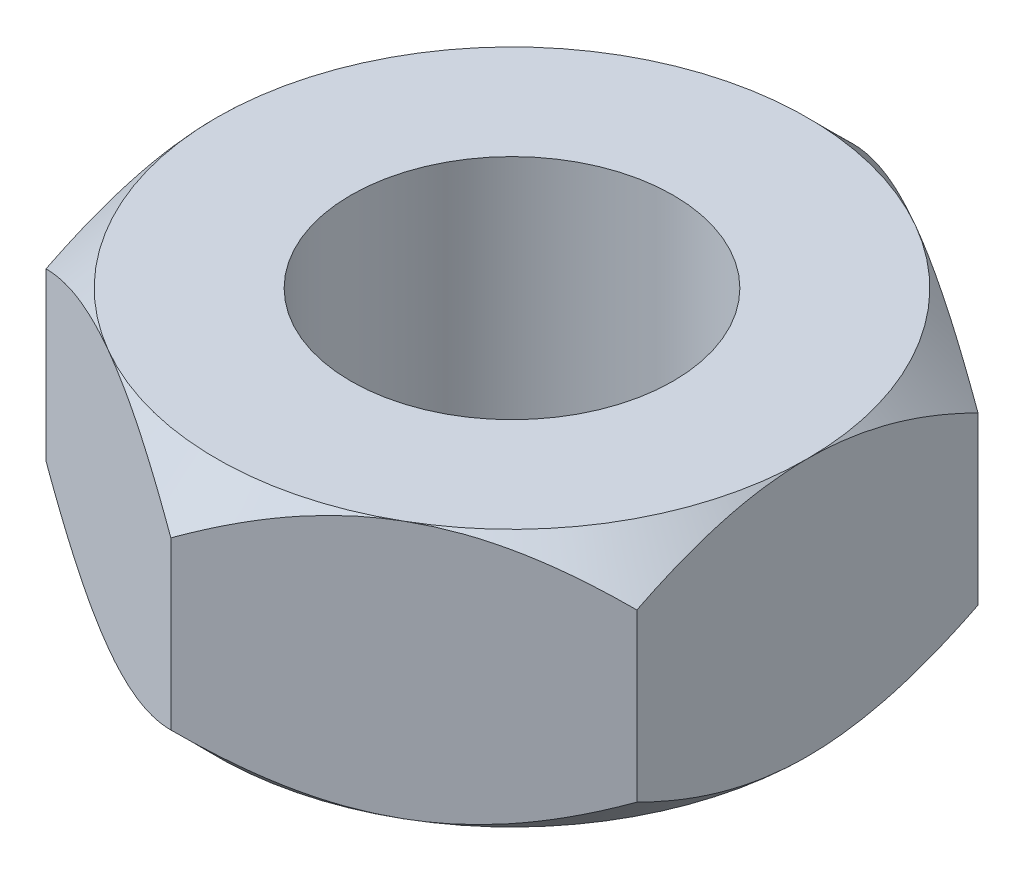
ISO-10303-21;
HEADER;
FILE_DESCRIPTION(('STEP AP214'),'2;1');
FILE_NAME('part.step','',(''),(''),'','','');
FILE_SCHEMA(('AUTOMOTIVE_DESIGN { 1 0 10303 214 1 1 1 1 }'));
ENDSEC;
DATA;
#1=APPLICATION_CONTEXT('core data for automotive mechanical design processes');
#2=APPLICATION_PROTOCOL_DEFINITION('international standard','automotive_design',2000,#1);
#3=PRODUCT_CONTEXT('',#1,'mechanical');
#4=PRODUCT('Part','Part','',(#3));
#5=PRODUCT_RELATED_PRODUCT_CATEGORY('part','',(#4));
#6=PRODUCT_DEFINITION_FORMATION('','',#4);
#7=PRODUCT_DEFINITION_CONTEXT('part definition',#1,'design');
#8=PRODUCT_DEFINITION('design','',#6,#7);
#9=PRODUCT_DEFINITION_SHAPE('','',#8);
#10=(LENGTH_UNIT() NAMED_UNIT(*) SI_UNIT(.MILLI.,.METRE.));
#11=(NAMED_UNIT(*) PLANE_ANGLE_UNIT() SI_UNIT($,.RADIAN.));
#12=(NAMED_UNIT(*) SI_UNIT($,.STERADIAN.) SOLID_ANGLE_UNIT());
#13=UNCERTAINTY_MEASURE_WITH_UNIT(LENGTH_MEASURE(1.E-05),#10,'distance_accuracy_value','');
#14=(GEOMETRIC_REPRESENTATION_CONTEXT(3) GLOBAL_UNCERTAINTY_ASSIGNED_CONTEXT((#13)) GLOBAL_UNIT_ASSIGNED_CONTEXT((#10,
#11,#12)) REPRESENTATION_CONTEXT('',''));
#15=CARTESIAN_POINT('',(0.,0.,0.));
#16=DIRECTION('',(0.,0.,1.));
#17=DIRECTION('',(1.,0.,0.));
#18=AXIS2_PLACEMENT_3D('',#15,#16,#17);
#19=CARTESIAN_POINT('',(2.75,2.4,-1.58771324027147));
#20=DIRECTION('',(-0.5,0.,0.866025403784439));
#21=DIRECTION('',(0.866025403784439,0.,0.5));
#22=AXIS2_PLACEMENT_3D('',#19,#20,#21);
#23=PLANE('',#22);
#24=CARTESIAN_POINT('',(-0.000200000000000099,0.425541956894917,-3.17554195059678));
#25=CARTESIAN_POINT('',(0.0943308997251542,0.371010993648795,-3.12096451019372));
#26=CARTESIAN_POINT('',(0.190442479964884,0.319682711582697,-3.06547446347008));
#27=CARTESIAN_POINT('',(0.386424562220433,0.225701848080582,-2.95232415552349));
#28=CARTESIAN_POINT('',(0.486313702554479,0.183101557290613,-2.89465313346251));
#29=CARTESIAN_POINT('',(0.687735384613651,0.110126428064951,-2.77836227110502));
#30=CARTESIAN_POINT('',(0.789216629687066,0.0795681696782812,-2.71977204694419));
#31=CARTESIAN_POINT('',(0.994413197899185,0.0324868359858975,-2.60130175305013));
#32=CARTESIAN_POINT('',(1.0981222526129,0.0159286158992995,-2.54142530239377));
#33=CARTESIAN_POINT('',(1.27685963791476,0.000988807876371814,-2.43823122487549));
#34=CARTESIAN_POINT('',(1.3516570606668,-0.00122274739977228,-2.39504691271491));
#35=CARTESIAN_POINT('',(1.50112963486142,0.00250321758747816,-2.30874888176718));
#36=CARTESIAN_POINT('',(1.57580473425184,0.00844359470887878,-2.26563519303236));
#37=CARTESIAN_POINT('',(1.72444981947433,0.0281353796034435,-2.17981491306544));
#38=CARTESIAN_POINT('',(1.79841892228176,0.041895524927416,-2.13710883164785));
#39=CARTESIAN_POINT('',(1.94507802102907,0.0764715186152213,-2.05243516150698));
#40=CARTESIAN_POINT('',(2.01776811458046,0.0972868260643694,-2.01046751642767));
#41=CARTESIAN_POINT('',(2.2039546543123,0.159080271248456,-1.90297266759401));
#42=CARTESIAN_POINT('',(2.31629676656898,0.204715808523916,-1.83811191884128));
#43=CARTESIAN_POINT('',(2.48148610419533,0.281754639324321,-1.74273981029545));
#44=CARTESIAN_POINT('',(2.53592338410088,0.308822507519967,-1.71131043208803));
#45=CARTESIAN_POINT('',(2.64378961648056,0.365425651693315,-1.64903383378715));
#46=CARTESIAN_POINT('',(2.69721916353136,0.394959413135863,-1.61818627041469));
#47=CARTESIAN_POINT('',(2.7502,0.425541956894916,-1.58759777021763));
#48=B_SPLINE_CURVE_WITH_KNOTS('',3,(#24,#25,#26,#27,#28,#29,#30,#31,#32,#33,#34,#35,#36,#37,#38,
#39,#40,#41,#42,#43,#44,#45,#46,#47),.UNSPECIFIED.,.F.,.F.,(4,2,2,2,2,2,2,2,2,2,2,4),(0.,
0.366307821078206,0.734749902229767,1.09734036165939,1.45901787214335,1.71784182927395,
1.97675651485027,2.23596107357797,2.49514576375463,2.90682558871158,3.11210731416953,
3.31726387159445),.UNSPECIFIED.);
#49=CARTESIAN_POINT('',(0.,0.425426480542941,-3.17542648054294));
#50=VERTEX_POINT('',#49);
#51=CARTESIAN_POINT('',(1.375,0.,-2.38156986040721));
#52=VERTEX_POINT('',#51);
#53=EDGE_CURVE('E53',#50,#52,#48,.T.);
#54=ORIENTED_EDGE('',*,*,#53,.F.);
#55=DIRECTION('',(0.,-1.,0.));
#56=VECTOR('',#55,1.);
#57=CARTESIAN_POINT('',(0.,2.4,-3.17542648054294));
#58=LINE('',#57,#56);
#59=CARTESIAN_POINT('',(0.,1.97457351945706,-3.17542648054294));
#60=VERTEX_POINT('',#59);
#61=EDGE_CURVE('E279',#60,#50,#58,.T.);
#62=ORIENTED_EDGE('',*,*,#61,.F.);
#63=CARTESIAN_POINT('',(2.7502,1.97445804310508,-1.58759777021763));
#64=CARTESIAN_POINT('',(2.65566910027485,2.02898900635121,-1.64217521062069));
#65=CARTESIAN_POINT('',(2.55955752003512,2.0803172884173,-1.69766525734434));
#66=CARTESIAN_POINT('',(2.36357543777957,2.17429815191942,-1.81081556529092));
#67=CARTESIAN_POINT('',(2.26368629744552,2.21689844270939,-1.8684865873519));
#68=CARTESIAN_POINT('',(2.06226461538635,2.28987357193505,-1.98477744970939));
#69=CARTESIAN_POINT('',(1.96078337031294,2.32043183032172,-2.04336767387023));
#70=CARTESIAN_POINT('',(1.75558680210082,2.3675131640141,-2.16183796776428));
#71=CARTESIAN_POINT('',(1.65187774738711,2.3840713841007,-2.22171441842064));
#72=CARTESIAN_POINT('',(1.47314036208524,2.39901119212363,-2.32490849593893));
#73=CARTESIAN_POINT('',(1.3983429393332,2.40122274739977,-2.3680928080995));
#74=CARTESIAN_POINT('',(1.24887036513858,2.39749678241252,-2.45439083904724));
#75=CARTESIAN_POINT('',(1.17419526574817,2.39155640529112,-2.49750452778206));
#76=CARTESIAN_POINT('',(1.02555018052567,2.37186462039656,-2.58332480774898));
#77=CARTESIAN_POINT('',(0.951581077718242,2.35810447507258,-2.62603088916656));
#78=CARTESIAN_POINT('',(0.804921978970933,2.32352848138478,-2.71070455930743));
#79=CARTESIAN_POINT('',(0.732231885419547,2.30271317393563,-2.75267220438674));
#80=CARTESIAN_POINT('',(0.546045345687704,2.24091972875154,-2.86016705322041));
#81=CARTESIAN_POINT('',(0.43370323343102,2.19528419147608,-2.92502780197313));
#82=CARTESIAN_POINT('',(0.268513895804666,2.11824536067568,-3.02039991051896));
#83=CARTESIAN_POINT('',(0.214076615899116,2.09117749248003,-3.05182928872638));
#84=CARTESIAN_POINT('',(0.106210383519439,2.03457434830668,-3.11410588702726));
#85=CARTESIAN_POINT('',(0.0527808364686395,2.00504058686414,-3.14495345039972));
#86=CARTESIAN_POINT('',(-0.000200000000000289,1.97445804310508,-3.17554195059678));
#87=B_SPLINE_CURVE_WITH_KNOTS('',3,(#63,#64,#65,#66,#67,#68,#69,#70,#71,#72,#73,#74,#75,#76,#77,
#78,#79,#80,#81,#82,#83,#84,#85,#86),.UNSPECIFIED.,.F.,.F.,(4,2,2,2,2,2,2,2,2,2,2,4),(0.,
0.366307821078205,0.734749902229765,1.09734036165939,1.45901787214334,1.71784182927395,
1.97675651485027,2.23596107357797,2.49514576375463,2.90682558871158,3.11210731416953,
3.31726387159445),.UNSPECIFIED.);
#88=CARTESIAN_POINT('',(1.375,2.4,-2.38156986040721));
#89=VERTEX_POINT('',#88);
#90=EDGE_CURVE('E251',#89,#60,#87,.T.);
#91=ORIENTED_EDGE('',*,*,#90,.F.);
#92=CARTESIAN_POINT('',(2.75,1.97457351945706,-1.58771324027147));
#93=VERTEX_POINT('',#92);
#94=EDGE_CURVE('E319',#93,#89,#87,.T.);
#95=ORIENTED_EDGE('',*,*,#94,.F.);
#96=DIRECTION('',(0.,-1.,0.));
#97=VECTOR('',#96,1.);
#98=CARTESIAN_POINT('',(2.75,2.4,-1.58771324027147));
#99=LINE('',#98,#97);
#100=CARTESIAN_POINT('',(2.75,0.42542648054294,-1.58771324027147));
#101=VERTEX_POINT('',#100);
#102=EDGE_CURVE('E321',#93,#101,#99,.T.);
#103=ORIENTED_EDGE('',*,*,#102,.T.);
#104=EDGE_CURVE('E138',#52,#101,#48,.T.);
#105=ORIENTED_EDGE('',*,*,#104,.F.);
#106=EDGE_LOOP('',(#54,#62,#91,#95,#103,#105));
#107=FACE_BOUND('',#106,.T.);
#108=ADVANCED_FACE('F37',(#107),#23,.F.);
#109=CARTESIAN_POINT('',(0.,2.4,-3.17542648054294));
#110=DIRECTION('',(0.5,0.,0.866025403784439));
#111=DIRECTION('',(0.866025403784439,0.,-0.5));
#112=AXIS2_PLACEMENT_3D('',#109,#110,#111);
#113=PLANE('',#112);
#114=CARTESIAN_POINT('',(-2.7502,0.425541956894916,-1.58759777021763));
#115=CARTESIAN_POINT('',(-2.65566910027485,0.371010993648794,-1.64217521062069));
#116=CARTESIAN_POINT('',(-2.55955752003512,0.319682711582697,-1.69766525734434));
#117=CARTESIAN_POINT('',(-2.36357543777957,0.225701848080582,-1.81081556529092));
#118=CARTESIAN_POINT('',(-2.26368629744552,0.183101557290614,-1.8684865873519));
#119=CARTESIAN_POINT('',(-2.06226461538635,0.110126428064951,-1.98477744970939));
#120=CARTESIAN_POINT('',(-1.96078337031294,0.0795681696782818,-2.04336767387023));
#121=CARTESIAN_POINT('',(-1.75558680210082,0.0324868359858976,-2.16183796776428));
#122=CARTESIAN_POINT('',(-1.65187774738711,0.0159286158992991,-2.22171441842064));
#123=CARTESIAN_POINT('',(-1.47314036208524,0.000988807876371699,-2.32490849593893));
#124=CARTESIAN_POINT('',(-1.3983429393332,-0.00122274739977196,-2.36809280809951));
#125=CARTESIAN_POINT('',(-1.24887036513858,0.00250321758747849,-2.45439083904724));
#126=CARTESIAN_POINT('',(-1.17419526574816,0.00844359470887866,-2.49750452778206));
#127=CARTESIAN_POINT('',(-1.02555018052567,0.0281353796034432,-2.58332480774898));
#128=CARTESIAN_POINT('',(-0.951581077718242,0.0418955249274158,-2.62603088916656));
#129=CARTESIAN_POINT('',(-0.804921978970932,0.076471518615221,-2.71070455930743));
#130=CARTESIAN_POINT('',(-0.732231885419546,0.0972868260643687,-2.75267220438674));
#131=CARTESIAN_POINT('',(-0.546045345687703,0.159080271248456,-2.86016705322041));
#132=CARTESIAN_POINT('',(-0.43370323343102,0.204715808523916,-2.92502780197313));
#133=CARTESIAN_POINT('',(-0.268513895804666,0.281754639324322,-3.02039991051896));
#134=CARTESIAN_POINT('',(-0.214076615899116,0.308822507519967,-3.05182928872638));
#135=CARTESIAN_POINT('',(-0.106210383519439,0.365425651693316,-3.11410588702726));
#136=CARTESIAN_POINT('',(-0.0527808364686401,0.394959413135863,-3.14495345039972));
#137=CARTESIAN_POINT('',(0.000199999999999838,0.425541956894917,-3.17554195059678));
#138=B_SPLINE_CURVE_WITH_KNOTS('',3,(#114,#115,#116,#117,#118,#119,#120,#121,#122,#123,#124,
#125,#126,#127,#128,#129,#130,#131,#132,#133,#134,#135,#136,#137),.UNSPECIFIED.,.F.,.F.,(4,2,2,
2,2,2,2,2,2,2,2,4),(0.,0.366307821078205,0.734749902229765,1.09734036165939,1.45901787214334,
1.71784182927395,1.97675651485027,2.23596107357797,2.49514576375463,2.90682558871158,
3.11210731416953,3.31726387159445),.UNSPECIFIED.);
#139=CARTESIAN_POINT('',(-2.75,0.425426480542941,-1.58771324027147));
#140=VERTEX_POINT('',#139);
#141=CARTESIAN_POINT('',(-1.375,0.,-2.38156986040721));
#142=VERTEX_POINT('',#141);
#143=EDGE_CURVE('E61',#140,#142,#138,.T.);
#144=ORIENTED_EDGE('',*,*,#143,.F.);
#145=DIRECTION('',(0.,-1.,0.));
#146=VECTOR('',#145,1.);
#147=CARTESIAN_POINT('',(-2.75,2.4,-1.58771324027147));
#148=LINE('',#147,#146);
#149=CARTESIAN_POINT('',(-2.75,1.97457351945706,-1.58771324027147));
#150=VERTEX_POINT('',#149);
#151=EDGE_CURVE('E272',#150,#140,#148,.T.);
#152=ORIENTED_EDGE('',*,*,#151,.F.);
#153=CARTESIAN_POINT('',(0.000200000000000003,1.97445804310508,-3.17554195059678));
#154=CARTESIAN_POINT('',(-0.0943308997251543,2.02898900635121,-3.12096451019372));
#155=CARTESIAN_POINT('',(-0.190442479964884,2.0803172884173,-3.06547446347008));
#156=CARTESIAN_POINT('',(-0.386424562220432,2.17429815191942,-2.95232415552349));
#157=CARTESIAN_POINT('',(-0.486313702554478,2.21689844270939,-2.89465313346251));
#158=CARTESIAN_POINT('',(-0.68773538461365,2.28987357193505,-2.77836227110502));
#159=CARTESIAN_POINT('',(-0.789216629687065,2.32043183032172,-2.71977204694419));
#160=CARTESIAN_POINT('',(-0.994413197899184,2.3675131640141,-2.60130175305013));
#161=CARTESIAN_POINT('',(-1.09812225261289,2.3840713841007,-2.54142530239377));
#162=CARTESIAN_POINT('',(-1.27685963791476,2.39901119212363,-2.43823122487549));
#163=CARTESIAN_POINT('',(-1.3516570606668,2.40122274739977,-2.39504691271491));
#164=CARTESIAN_POINT('',(-1.50112963486142,2.39749678241252,-2.30874888176718));
#165=CARTESIAN_POINT('',(-1.57580473425184,2.39155640529112,-2.26563519303236));
#166=CARTESIAN_POINT('',(-1.72444981947433,2.37186462039656,-2.17981491306544));
#167=CARTESIAN_POINT('',(-1.79841892228176,2.35810447507258,-2.13710883164785));
#168=CARTESIAN_POINT('',(-1.94507802102907,2.32352848138478,-2.05243516150699));
#169=CARTESIAN_POINT('',(-2.01776811458045,2.30271317393563,-2.01046751642767));
#170=CARTESIAN_POINT('',(-2.2039546543123,2.24091972875154,-1.90297266759401));
#171=CARTESIAN_POINT('',(-2.31629676656898,2.19528419147609,-1.83811191884128));
#172=CARTESIAN_POINT('',(-2.48148610419533,2.11824536067568,-1.74273981029545));
#173=CARTESIAN_POINT('',(-2.53592338410088,2.09117749248003,-1.71131043208803));
#174=CARTESIAN_POINT('',(-2.64378961648056,2.03457434830668,-1.64903383378715));
#175=CARTESIAN_POINT('',(-2.69721916353136,2.00504058686414,-1.61818627041469));
#176=CARTESIAN_POINT('',(-2.7502,1.97445804310508,-1.58759777021763));
#177=B_SPLINE_CURVE_WITH_KNOTS('',3,(#153,#154,#155,#156,#157,#158,#159,#160,#161,#162,#163,
#164,#165,#166,#167,#168,#169,#170,#171,#172,#173,#174,#175,#176),.UNSPECIFIED.,.F.,.F.,(4,2,2,
2,2,2,2,2,2,2,2,4),(0.,0.366307821078205,0.734749902229766,1.09734036165939,1.45901787214334,
1.71784182927395,1.97675651485027,2.23596107357797,2.49514576375463,2.90682558871158,
3.11210731416953,3.31726387159445),.UNSPECIFIED.);
#178=CARTESIAN_POINT('',(-1.375,2.4,-2.38156986040721));
#179=VERTEX_POINT('',#178);
#180=EDGE_CURVE('E244',#179,#150,#177,.T.);
#181=ORIENTED_EDGE('',*,*,#180,.F.);
#182=EDGE_CURVE('E250',#60,#179,#177,.T.);
#183=ORIENTED_EDGE('',*,*,#182,.F.);
#184=ORIENTED_EDGE('',*,*,#61,.T.);
#185=EDGE_CURVE('E161',#142,#50,#138,.T.);
#186=ORIENTED_EDGE('',*,*,#185,.F.);
#187=EDGE_LOOP('',(#144,#152,#181,#183,#184,#186));
#188=FACE_BOUND('',#187,.T.);
#189=ADVANCED_FACE('F257',(#188),#113,.F.);
#190=CARTESIAN_POINT('',(-2.75,2.4,-1.58771324027147));
#191=DIRECTION('',(1.,0.,0.));
#192=DIRECTION('',(0.,0.,-1.));
#193=AXIS2_PLACEMENT_3D('',#190,#191,#192);
#194=PLANE('',#193);
#195=CARTESIAN_POINT('',(-2.75,1.80782169527457,-3.63472675808177));
#196=CARTESIAN_POINT('',(-2.75,1.73868159551658,-3.54800867067655));
#197=CARTESIAN_POINT('',(-2.75,1.67007152903523,-3.46086174429199));
#198=CARTESIAN_POINT('',(-2.75,1.53416325044959,-3.28552270357419));
#199=CARTESIAN_POINT('',(-2.75,1.46686531570245,-3.1973303744659));
#200=CARTESIAN_POINT('',(-2.75,1.33335903557361,-3.01907729974752));
#201=CARTESIAN_POINT('',(-2.75,1.2671627878523,-2.92900746585664));
#202=CARTESIAN_POINT('',(-2.75,1.13676455184732,-2.74744101818951));
#203=CARTESIAN_POINT('',(-2.75,1.07256243131223,-2.65594449963875));
#204=CARTESIAN_POINT('',(-2.75,0.941745248508466,-2.46409925523252));
#205=CARTESIAN_POINT('',(-2.75,0.875329084918676,-2.3636142377344));
#206=CARTESIAN_POINT('',(-2.75,0.746158624444778,-2.16027647672889));
#207=CARTESIAN_POINT('',(-2.75,0.68340501793316,-2.05742329189705));
#208=CARTESIAN_POINT('',(-2.75,0.562856570845539,-1.8492435063339));
#209=CARTESIAN_POINT('',(-2.75,0.50504735060869,-1.74392529752241));
#210=CARTESIAN_POINT('',(-2.75,0.395682588757715,-1.5301155942557));
#211=CARTESIAN_POINT('',(-2.75,0.344123869356362,-1.42162574739516));
#212=CARTESIAN_POINT('',(-2.75,0.255439473232211,-1.21557860926834));
#213=CARTESIAN_POINT('',(-2.75,0.217307461761922,-1.11845883443871));
#214=CARTESIAN_POINT('',(-2.75,0.148806889645974,-0.92146704516136));
#215=CARTESIAN_POINT('',(-2.75,0.118438769533651,-0.821594874895153));
#216=CARTESIAN_POINT('',(-2.75,0.0677604472481918,-0.62161914474097));
#217=CARTESIAN_POINT('',(-2.75,0.0472440969261089,-0.521568786900464));
#218=CARTESIAN_POINT('',(-2.75,0.0167483594558441,-0.319865742327765));
#219=CARTESIAN_POINT('',(-2.75,0.00676577598925033,-0.218213551156163));
#220=CARTESIAN_POINT('',(-2.75,-0.00157687572346488,-0.0208373501382752));
#221=CARTESIAN_POINT('',(-2.75,-0.000628511059595918,0.0748573605473662));
#222=CARTESIAN_POINT('',(-2.75,0.0111576990061719,0.265630424655448));
#223=CARTESIAN_POINT('',(-2.75,0.02199628258147,0.360708731538079));
#224=CARTESIAN_POINT('',(-2.75,0.0530880564530927,0.551195413679047));
#225=CARTESIAN_POINT('',(-2.75,0.0735211251617086,0.646573915648193));
#226=CARTESIAN_POINT('',(-2.75,0.122575452767828,0.835153532568136));
#227=CARTESIAN_POINT('',(-2.75,0.151196768347713,0.928354632441237));
#228=CARTESIAN_POINT('',(-2.75,0.247149315140357,1.20424714804417));
#229=CARTESIAN_POINT('',(-2.75,0.324606232348532,1.38342193830838));
#230=CARTESIAN_POINT('',(-2.75,0.453905269945921,1.64568755109808));
#231=CARTESIAN_POINT('',(-2.75,0.499287963555073,1.73218258063299));
#232=CARTESIAN_POINT('',(-2.75,0.593599497618929,1.90322180873612));
#233=CARTESIAN_POINT('',(-2.75,0.642527734399097,1.98776633618587));
#234=CARTESIAN_POINT('',(-2.75,0.740735245182958,2.15099198708662));
#235=CARTESIAN_POINT('',(-2.75,0.789877652953672,2.22975638476951));
#236=CARTESIAN_POINT('',(-2.75,0.890275075791379,2.38593351043466));
#237=CARTESIAN_POINT('',(-2.75,0.941530246026375,2.46334613854213));
#238=CARTESIAN_POINT('',(-2.75,1.04536650287476,2.61638053077002));
#239=CARTESIAN_POINT('',(-2.75,1.09793391540512,2.69201161152898));
#240=CARTESIAN_POINT('',(-2.75,1.20449319001727,2.84223348207388));
#241=CARTESIAN_POINT('',(-2.75,1.25848465634406,2.9168245522587));
#242=CARTESIAN_POINT('',(-2.75,1.31305976410436,2.99097887767262));
#243=B_SPLINE_CURVE_WITH_KNOTS('',3,(#195,#196,#197,#198,#199,#200,#201,#202,#203,#204,#205,
#206,#207,#208,#209,#210,#211,#212,#213,#214,#215,#216,#217,#218,#219,#220,#221,#222,#223,#224,
#225,#226,#227,#228,#229,#230,#231,#232,#233,#234,#235,#236,#237,#238,#239,#240,#241,#242),
.UNSPECIFIED.,.F.,.F.,(4,2,2,2,2,2,2,2,2,2,2,2,2,2,2,2,2,2,2,2,2,2,2,4),(0.,0.332726398416979,
0.665522381979931,1.00083652102681,1.33612837419665,1.69741813709914,2.05877578270462,
2.41904398029681,2.77912824062089,3.09187955419582,3.4046486097522,3.71055208748452,
4.01636271653859,4.30293767779627,4.58953402981583,4.88173223710371,5.17393246715563,
5.7577463850899,6.05075334560179,6.34371053458314,6.62218871981018,6.90068739392989,
7.17698586222037,7.45320833779313),.UNSPECIFIED.);
#244=CARTESIAN_POINT('',(-2.75,0.42542648054294,1.58771324027147));
#245=VERTEX_POINT('',#244);
#246=CARTESIAN_POINT('',(-2.75,0.,0.));
#247=VERTEX_POINT('',#246);
#248=EDGE_CURVE('E348',#245,#247,#243,.F.);
#249=ORIENTED_EDGE('',*,*,#248,.F.);
#250=DIRECTION('',(0.,-1.,0.));
#251=VECTOR('',#250,1.);
#252=CARTESIAN_POINT('',(-2.75,2.4,1.58771324027147));
#253=LINE('',#252,#251);
#254=CARTESIAN_POINT('',(-2.75,1.97457351945706,1.58771324027147));
#255=VERTEX_POINT('',#254);
#256=EDGE_CURVE('E280',#255,#245,#253,.T.);
#257=ORIENTED_EDGE('',*,*,#256,.F.);
#258=CARTESIAN_POINT('',(-2.75,0.594673478463379,-3.63159740580023));
#259=CARTESIAN_POINT('',(-2.75,0.663739111924605,-3.54494552829104));
#260=CARTESIAN_POINT('',(-2.75,0.732274508966954,-3.45786477734647));
#261=CARTESIAN_POINT('',(-2.75,0.868033033811392,-3.28265811574197));
#262=CARTESIAN_POINT('',(-2.75,0.93525588384878,-3.19453199006624));
#263=CARTESIAN_POINT('',(-2.75,1.06861112137974,-3.01641179952862));
#264=CARTESIAN_POINT('',(-2.75,1.13473140501707,-2.92640864522205));
#265=CARTESIAN_POINT('',(-2.75,1.26497730946444,-2.74497587681638));
#266=CARTESIAN_POINT('',(-2.75,1.32910306258631,-2.65354635794529));
#267=CARTESIAN_POINT('',(-2.75,1.45975239387915,-2.46185395660671));
#268=CARTESIAN_POINT('',(-2.75,1.52607742368194,-2.36145508857773));
#269=CARTESIAN_POINT('',(-2.75,1.65506661758575,-2.15829160376715));
#270=CARTESIAN_POINT('',(-2.75,1.71773009219196,-2.05552654646311));
#271=CARTESIAN_POINT('',(-2.75,1.83810075222815,-1.84752580359659));
#272=CARTESIAN_POINT('',(-2.75,1.8958223125185,-1.74229850199546));
#273=CARTESIAN_POINT('',(-2.75,2.00501617859217,-1.52867505662383));
#274=CARTESIAN_POINT('',(-2.75,2.05649165788959,-1.42028055707746));
#275=CARTESIAN_POINT('',(-2.75,2.145041442528,-1.2143866677897));
#276=CARTESIAN_POINT('',(-2.75,2.18311908483294,-1.11732315321433));
#277=CARTESIAN_POINT('',(-2.75,2.25151549029559,-0.920448074795203));
#278=CARTESIAN_POINT('',(-2.75,2.28183381291981,-0.820636355278947));
#279=CARTESIAN_POINT('',(-2.75,2.33242238922476,-0.620782282547017));
#280=CARTESIAN_POINT('',(-2.75,2.35289835380935,-0.520792956085535));
#281=CARTESIAN_POINT('',(-2.75,2.38332454904157,-0.319216328962869));
#282=CARTESIAN_POINT('',(-2.75,2.39327796131864,-0.217629520754702));
#283=CARTESIAN_POINT('',(-2.75,2.40157901754498,-0.0203618089324159));
#284=CARTESIAN_POINT('',(-2.75,2.40061517105113,0.0752900556449629));
#285=CARTESIAN_POINT('',(-2.75,2.38880745953746,0.265976621504535));
#286=CARTESIAN_POINT('',(-2.75,2.37796285544783,0.361011276084556));
#287=CARTESIAN_POINT('',(-2.75,2.34686833752141,0.551409131527276));
#288=CARTESIAN_POINT('',(-2.75,2.32643886053925,0.646742495494801));
#289=CARTESIAN_POINT('',(-2.75,2.27739986684718,0.835233634308708));
#290=CARTESIAN_POINT('',(-2.75,2.2487902988343,0.928391395506425));
#291=CARTESIAN_POINT('',(-2.75,2.15285297108737,1.20424142323776));
#292=CARTESIAN_POINT('',(-2.75,2.07539640825469,1.38341606255962));
#293=CARTESIAN_POINT('',(-2.75,1.94609784707569,1.64568148824613));
#294=CARTESIAN_POINT('',(-2.75,1.90071528084546,1.73217649781341));
#295=CARTESIAN_POINT('',(-2.75,1.80640398919626,1.90321568433073));
#296=CARTESIAN_POINT('',(-2.75,1.75747586756832,1.98776019022428));
#297=CARTESIAN_POINT('',(-2.75,1.65926825305651,2.15098632417002));
#298=CARTESIAN_POINT('',(-2.75,1.61012560983678,2.22975121626724));
#299=CARTESIAN_POINT('',(-2.75,1.50972768251469,2.38592931253249));
#300=CARTESIAN_POINT('',(-2.75,1.45847224321192,2.463342416805));
#301=CARTESIAN_POINT('',(-2.75,1.35463546676218,2.61637768067024));
#302=CARTESIAN_POINT('',(-2.75,1.30206780525705,2.69200915795809));
#303=CARTESIAN_POINT('',(-2.75,1.19550801676403,2.84223180840298));
#304=CARTESIAN_POINT('',(-2.75,1.14151628556263,2.91682326198111));
#305=CARTESIAN_POINT('',(-2.75,1.0869409068436,2.99097796623128));
#306=B_SPLINE_CURVE_WITH_KNOTS('',3,(#258,#259,#260,#261,#262,#263,#264,#265,#266,#267,#268,
#269,#270,#271,#272,#273,#274,#275,#276,#277,#278,#279,#280,#281,#282,#283,#284,#285,#286,#287,
#288,#289,#290,#291,#292,#293,#294,#295,#296,#297,#298,#299,#300,#301,#302,#303,#304,#305),
.UNSPECIFIED.,.F.,.F.,(4,2,2,2,2,2,2,2,2,2,2,2,2,2,2,2,2,2,2,2,2,2,2,4),(0.,0.33243182981604,
0.664933263509031,0.999951237182682,1.33494693905071,1.69587033067351,2.05686146894863,
2.41676411852393,2.77648313590662,3.0890178571753,3.4015703185919,3.70727074194454,
4.01287870637057,4.29932630149118,4.58579532433567,4.87785952749248,5.16992556242528,
5.753738530255,6.04674526834512,6.33970222553057,6.61818204257394,6.89668235258914,
7.172982223686,7.44920609652945),.UNSPECIFIED.);
#307=CARTESIAN_POINT('',(-2.75,2.4,0.));
#308=VERTEX_POINT('',#307);
#309=EDGE_CURVE('E237',#308,#255,#306,.T.);
#310=ORIENTED_EDGE('',*,*,#309,.F.);
#311=EDGE_CURVE('E243',#150,#308,#306,.T.);
#312=ORIENTED_EDGE('',*,*,#311,.F.);
#313=ORIENTED_EDGE('',*,*,#151,.T.);
#314=EDGE_CURVE('E196',#247,#140,#243,.F.);
#315=ORIENTED_EDGE('',*,*,#314,.F.);
#316=EDGE_LOOP('',(#249,#257,#310,#312,#313,#315));
#317=FACE_BOUND('',#316,.T.);
#318=ADVANCED_FACE('F218',(#317),#194,.F.);
#319=CARTESIAN_POINT('',(-2.75,2.4,1.58771324027147));
#320=DIRECTION('',(0.5,0.,-0.866025403784439));
#321=DIRECTION('',(-0.866025403784439,0.,-0.5));
#322=AXIS2_PLACEMENT_3D('',#319,#320,#321);
#323=PLANE('',#322);
#324=CARTESIAN_POINT('',(0.000199999999999823,0.425541956894916,3.17554195059678));
#325=CARTESIAN_POINT('',(-0.0943308997251543,0.371010993648794,3.12096451019372));
#326=CARTESIAN_POINT('',(-0.190442479964884,0.319682711582696,3.06547446347008));
#327=CARTESIAN_POINT('',(-0.386424562220432,0.225701848080581,2.95232415552349));
#328=CARTESIAN_POINT('',(-0.486313702554479,0.183101557290613,2.89465313346251));
#329=CARTESIAN_POINT('',(-0.68773538461365,0.11012642806495,2.77836227110502));
#330=CARTESIAN_POINT('',(-0.789216629687065,0.079568169678281,2.71977204694419));
#331=CARTESIAN_POINT('',(-0.994413197899184,0.0324868359858968,2.60130175305013));
#332=CARTESIAN_POINT('',(-1.09812225261289,0.0159286158992984,2.54142530239377));
#333=CARTESIAN_POINT('',(-1.27685963791476,0.000988807876370727,2.43823122487549));
#334=CARTESIAN_POINT('',(-1.3516570606668,-0.00122274739977312,2.39504691271491));
#335=CARTESIAN_POINT('',(-1.50112963486142,0.00250321758747727,2.30874888176718));
#336=CARTESIAN_POINT('',(-1.57580473425184,0.0084435947088776,2.26563519303236));
#337=CARTESIAN_POINT('',(-1.72444981947433,0.0281353796034423,2.17981491306544));
#338=CARTESIAN_POINT('',(-1.79841892228176,0.041895524927415,2.13710883164785));
#339=CARTESIAN_POINT('',(-1.94507802102907,0.0764715186152203,2.05243516150698));
#340=CARTESIAN_POINT('',(-2.01776811458045,0.097286826064368,2.01046751642767));
#341=CARTESIAN_POINT('',(-2.2039546543123,0.159080271248455,1.90297266759401));
#342=CARTESIAN_POINT('',(-2.31629676656898,0.204715808523915,1.83811191884128));
#343=CARTESIAN_POINT('',(-2.48148610419533,0.281754639324321,1.74273981029545));
#344=CARTESIAN_POINT('',(-2.53592338410088,0.308822507519967,1.71131043208803));
#345=CARTESIAN_POINT('',(-2.64378961648056,0.365425651693315,1.64903383378715));
#346=CARTESIAN_POINT('',(-2.69721916353136,0.394959413135863,1.61818627041469));
#347=CARTESIAN_POINT('',(-2.7502,0.425541956894915,1.58759777021763));
#348=B_SPLINE_CURVE_WITH_KNOTS('',3,(#324,#325,#326,#327,#328,#329,#330,#331,#332,#333,#334,
#335,#336,#337,#338,#339,#340,#341,#342,#343,#344,#345,#346,#347),.UNSPECIFIED.,.F.,.F.,(4,2,2,
2,2,2,2,2,2,2,2,4),(0.,0.366307821078205,0.734749902229766,1.09734036165939,1.45901787214334,
1.71784182927395,1.97675651485027,2.23596107357797,2.49514576375463,2.90682558871158,
3.11210731416953,3.31726387159445),.UNSPECIFIED.);
#349=CARTESIAN_POINT('',(0.,0.42542648054294,3.17542648054294));
#350=VERTEX_POINT('',#349);
#351=CARTESIAN_POINT('',(-1.375,0.,2.38156986040721));
#352=VERTEX_POINT('',#351);
#353=EDGE_CURVE('E147',#350,#352,#348,.T.);
#354=ORIENTED_EDGE('',*,*,#353,.F.);
#355=DIRECTION('',(0.,-1.,0.));
#356=VECTOR('',#355,1.);
#357=CARTESIAN_POINT('',(0.,2.4,3.17542648054294));
#358=LINE('',#357,#356);
#359=CARTESIAN_POINT('',(0.,1.97457351945706,3.17542648054294));
#360=VERTEX_POINT('',#359);
#361=EDGE_CURVE('E160',#360,#350,#358,.T.);
#362=ORIENTED_EDGE('',*,*,#361,.F.);
#363=CARTESIAN_POINT('',(-2.7502,1.97445804310508,1.58759777021763));
#364=CARTESIAN_POINT('',(-2.65566910027485,2.02898900635121,1.64217521062069));
#365=CARTESIAN_POINT('',(-2.55955752003512,2.0803172884173,1.69766525734434));
#366=CARTESIAN_POINT('',(-2.36357543777957,2.17429815191942,1.81081556529092));
#367=CARTESIAN_POINT('',(-2.26368629744552,2.21689844270939,1.8684865873519));
#368=CARTESIAN_POINT('',(-2.06226461538635,2.28987357193505,1.98477744970939));
#369=CARTESIAN_POINT('',(-1.96078337031294,2.32043183032172,2.04336767387023));
#370=CARTESIAN_POINT('',(-1.75558680210082,2.3675131640141,2.16183796776428));
#371=CARTESIAN_POINT('',(-1.65187774738711,2.3840713841007,2.22171441842064));
#372=CARTESIAN_POINT('',(-1.47314036208524,2.39901119212363,2.32490849593892));
#373=CARTESIAN_POINT('',(-1.3983429393332,2.40122274739977,2.3680928080995));
#374=CARTESIAN_POINT('',(-1.24887036513858,2.39749678241252,2.45439083904723));
#375=CARTESIAN_POINT('',(-1.17419526574816,2.39155640529112,2.49750452778206));
#376=CARTESIAN_POINT('',(-1.02555018052567,2.37186462039656,2.58332480774898));
#377=CARTESIAN_POINT('',(-0.951581077718241,2.35810447507258,2.62603088916656));
#378=CARTESIAN_POINT('',(-0.804921978970932,2.32352848138478,2.71070455930743));
#379=CARTESIAN_POINT('',(-0.732231885419546,2.30271317393563,2.75267220438674));
#380=CARTESIAN_POINT('',(-0.546045345687703,2.24091972875154,2.8601670532204));
#381=CARTESIAN_POINT('',(-0.43370323343102,2.19528419147609,2.92502780197313));
#382=CARTESIAN_POINT('',(-0.268513895804666,2.11824536067568,3.02039991051896));
#383=CARTESIAN_POINT('',(-0.214076615899116,2.09117749248003,3.05182928872638));
#384=CARTESIAN_POINT('',(-0.106210383519439,2.03457434830668,3.11410588702726));
#385=CARTESIAN_POINT('',(-0.0527808364686402,2.00504058686414,3.14495345039972));
#386=CARTESIAN_POINT('',(0.000199999999999627,1.97445804310508,3.17554195059678));
#387=B_SPLINE_CURVE_WITH_KNOTS('',3,(#363,#364,#365,#366,#367,#368,#369,#370,#371,#372,#373,
#374,#375,#376,#377,#378,#379,#380,#381,#382,#383,#384,#385,#386),.UNSPECIFIED.,.F.,.F.,(4,2,2,
2,2,2,2,2,2,2,2,4),(0.,0.366307821078205,0.734749902229766,1.09734036165939,1.45901787214334,
1.71784182927395,1.97675651485027,2.23596107357797,2.49514576375463,2.90682558871158,
3.11210731416953,3.31726387159445),.UNSPECIFIED.);
#388=CARTESIAN_POINT('',(-1.375,2.4,2.38156986040721));
#389=VERTEX_POINT('',#388);
#390=EDGE_CURVE('E223',#389,#360,#387,.T.);
#391=ORIENTED_EDGE('',*,*,#390,.F.);
#392=EDGE_CURVE('E230',#255,#389,#387,.T.);
#393=ORIENTED_EDGE('',*,*,#392,.F.);
#394=ORIENTED_EDGE('',*,*,#256,.T.);
#395=EDGE_CURVE('E163',#352,#245,#348,.T.);
#396=ORIENTED_EDGE('',*,*,#395,.F.);
#397=EDGE_LOOP('',(#354,#362,#391,#393,#394,#396));
#398=FACE_BOUND('',#397,.T.);
#399=ADVANCED_FACE('F215',(#398),#323,.F.);
#400=CARTESIAN_POINT('',(0.,2.4,3.17542648054294));
#401=DIRECTION('',(-0.5,0.,-0.866025403784439));
#402=DIRECTION('',(-0.866025403784439,0.,0.5));
#403=AXIS2_PLACEMENT_3D('',#400,#401,#402);
#404=PLANE('',#403);
#405=CARTESIAN_POINT('',(2.7502,0.425541956894916,1.58759777021763));
#406=CARTESIAN_POINT('',(2.65566910027484,0.371010993648794,1.64217521062069));
#407=CARTESIAN_POINT('',(2.55955752003512,0.319682711582697,1.69766525734434));
#408=CARTESIAN_POINT('',(2.36357543777957,0.225701848080581,1.81081556529092));
#409=CARTESIAN_POINT('',(2.26368629744552,0.183101557290613,1.8684865873519));
#410=CARTESIAN_POINT('',(2.06226461538635,0.110126428064951,1.98477744970939));
#411=CARTESIAN_POINT('',(1.96078337031293,0.0795681696782813,2.04336767387023));
#412=CARTESIAN_POINT('',(1.75558680210082,0.0324868359858972,2.16183796776428));
#413=CARTESIAN_POINT('',(1.65187774738711,0.0159286158992988,2.22171441842064));
#414=CARTESIAN_POINT('',(1.47314036208524,0.000988807876371232,2.32490849593893));
#415=CARTESIAN_POINT('',(1.3983429393332,-0.00122274739977255,2.36809280809951));
#416=CARTESIAN_POINT('',(1.24887036513858,0.00250321758747799,2.45439083904724));
#417=CARTESIAN_POINT('',(1.17419526574816,0.0084435947088784,2.49750452778206));
#418=CARTESIAN_POINT('',(1.02555018052567,0.028135379603443,2.58332480774898));
#419=CARTESIAN_POINT('',(0.95158107771824,0.0418955249274155,2.62603088916656));
#420=CARTESIAN_POINT('',(0.804921978970931,0.0764715186152208,2.71070455930743));
#421=CARTESIAN_POINT('',(0.732231885419545,0.0972868260643689,2.75267220438674));
#422=CARTESIAN_POINT('',(0.546045345687702,0.159080271248456,2.8601670532204));
#423=CARTESIAN_POINT('',(0.433703233431019,0.204715808523915,2.92502780197313));
#424=CARTESIAN_POINT('',(0.268513895804665,0.281754639324321,3.02039991051896));
#425=CARTESIAN_POINT('',(0.214076615899115,0.308822507519967,3.05182928872638));
#426=CARTESIAN_POINT('',(0.106210383519439,0.365425651693315,3.11410588702726));
#427=CARTESIAN_POINT('',(0.0527808364686393,0.394959413135863,3.14495345039972));
#428=CARTESIAN_POINT('',(-0.00020000000000056,0.425541956894916,3.17554195059678));
#429=B_SPLINE_CURVE_WITH_KNOTS('',3,(#405,#406,#407,#408,#409,#410,#411,#412,#413,#414,#415,
#416,#417,#418,#419,#420,#421,#422,#423,#424,#425,#426,#427,#428),.UNSPECIFIED.,.F.,.F.,(4,2,2,
2,2,2,2,2,2,2,2,4),(0.,0.366307821078205,0.734749902229766,1.09734036165939,1.45901787214334,
1.71784182927395,1.97675651485027,2.23596107357797,2.49514576375463,2.90682558871158,
3.11210731416953,3.31726387159445),.UNSPECIFIED.);
#430=CARTESIAN_POINT('',(2.75,0.425426480542941,1.58771324027147));
#431=VERTEX_POINT('',#430);
#432=CARTESIAN_POINT('',(1.375,0.,2.38156986040721));
#433=VERTEX_POINT('',#432);
#434=EDGE_CURVE('E127',#431,#433,#429,.T.);
#435=ORIENTED_EDGE('',*,*,#434,.F.);
#436=DIRECTION('',(0.,-1.,0.));
#437=VECTOR('',#436,1.);
#438=CARTESIAN_POINT('',(2.75,2.4,1.58771324027147));
#439=LINE('',#438,#437);
#440=CARTESIAN_POINT('',(2.75,1.97457351945706,1.58771324027147));
#441=VERTEX_POINT('',#440);
#442=EDGE_CURVE('E326',#441,#431,#439,.T.);
#443=ORIENTED_EDGE('',*,*,#442,.F.);
#444=CARTESIAN_POINT('',(-0.000200000000000271,1.97445804310508,3.17554195059678));
#445=CARTESIAN_POINT('',(0.094330899725154,2.02898900635121,3.12096451019372));
#446=CARTESIAN_POINT('',(0.190442479964883,2.0803172884173,3.06547446347008));
#447=CARTESIAN_POINT('',(0.386424562220432,2.17429815191942,2.95232415552349));
#448=CARTESIAN_POINT('',(0.486313702554479,2.21689844270939,2.89465313346251));
#449=CARTESIAN_POINT('',(0.68773538461365,2.28987357193505,2.77836227110502));
#450=CARTESIAN_POINT('',(0.789216629687065,2.32043183032172,2.71977204694419));
#451=CARTESIAN_POINT('',(0.994413197899184,2.3675131640141,2.60130175305013));
#452=CARTESIAN_POINT('',(1.09812225261289,2.3840713841007,2.54142530239377));
#453=CARTESIAN_POINT('',(1.27685963791476,2.39901119212363,2.43823122487549));
#454=CARTESIAN_POINT('',(1.3516570606668,2.40122274739977,2.39504691271491));
#455=CARTESIAN_POINT('',(1.50112963486142,2.39749678241252,2.30874888176718));
#456=CARTESIAN_POINT('',(1.57580473425184,2.39155640529112,2.26563519303236));
#457=CARTESIAN_POINT('',(1.72444981947433,2.37186462039656,2.17981491306544));
#458=CARTESIAN_POINT('',(1.79841892228176,2.35810447507258,2.13710883164785));
#459=CARTESIAN_POINT('',(1.94507802102907,2.32352848138478,2.05243516150698));
#460=CARTESIAN_POINT('',(2.01776811458046,2.30271317393563,2.01046751642767));
#461=CARTESIAN_POINT('',(2.2039546543123,2.24091972875154,1.90297266759401));
#462=CARTESIAN_POINT('',(2.31629676656898,2.19528419147608,1.83811191884128));
#463=CARTESIAN_POINT('',(2.48148610419533,2.11824536067568,1.74273981029545));
#464=CARTESIAN_POINT('',(2.53592338410088,2.09117749248003,1.71131043208803));
#465=CARTESIAN_POINT('',(2.64378961648056,2.03457434830668,1.64903383378715));
#466=CARTESIAN_POINT('',(2.69721916353136,2.00504058686414,1.6181862704147));
#467=CARTESIAN_POINT('',(2.7502,1.97445804310508,1.58759777021763));
#468=B_SPLINE_CURVE_WITH_KNOTS('',3,(#444,#445,#446,#447,#448,#449,#450,#451,#452,#453,#454,
#455,#456,#457,#458,#459,#460,#461,#462,#463,#464,#465,#466,#467),.UNSPECIFIED.,.F.,.F.,(4,2,2,
2,2,2,2,2,2,2,2,4),(0.,0.366307821078205,0.734749902229766,1.09734036165939,1.45901787214334,
1.71784182927395,1.97675651485027,2.23596107357797,2.49514576375463,2.90682558871158,
3.11210731416953,3.31726387159445),.UNSPECIFIED.);
#469=CARTESIAN_POINT('',(1.375,2.4,2.38156986040721));
#470=VERTEX_POINT('',#469);
#471=EDGE_CURVE('E232',#470,#441,#468,.T.);
#472=ORIENTED_EDGE('',*,*,#471,.F.);
#473=EDGE_CURVE('E231',#360,#470,#468,.T.);
#474=ORIENTED_EDGE('',*,*,#473,.F.);
#475=ORIENTED_EDGE('',*,*,#361,.T.);
#476=EDGE_CURVE('E141',#433,#350,#429,.T.);
#477=ORIENTED_EDGE('',*,*,#476,.F.);
#478=EDGE_LOOP('',(#435,#443,#472,#474,#475,#477));
#479=FACE_BOUND('',#478,.T.);
#480=ADVANCED_FACE('F157',(#479),#404,.F.);
#481=CARTESIAN_POINT('',(2.75,2.4,1.58771324027147));
#482=DIRECTION('',(-1.,0.,0.));
#483=DIRECTION('',(0.,0.,1.));
#484=AXIS2_PLACEMENT_3D('',#481,#482,#483);
#485=PLANE('',#484);
#486=CARTESIAN_POINT('',(2.75,1.80782169527457,-3.63472675808176));
#487=CARTESIAN_POINT('',(2.75,1.73868159551658,-3.54800867067655));
#488=CARTESIAN_POINT('',(2.75,1.67007152903523,-3.46086174429199));
#489=CARTESIAN_POINT('',(2.75,1.53416325044959,-3.28552270357418));
#490=CARTESIAN_POINT('',(2.75,1.46686531570245,-3.1973303744659));
#491=CARTESIAN_POINT('',(2.75,1.33335903557361,-3.01907729974752));
#492=CARTESIAN_POINT('',(2.75,1.2671627878523,-2.92900746585664));
#493=CARTESIAN_POINT('',(2.75,1.13676455184732,-2.74744101818951));
#494=CARTESIAN_POINT('',(2.75,1.07256243131223,-2.65594449963875));
#495=CARTESIAN_POINT('',(2.75,0.941745248508465,-2.46409925523252));
#496=CARTESIAN_POINT('',(2.75,0.875329084918675,-2.3636142377344));
#497=CARTESIAN_POINT('',(2.75,0.746158624444777,-2.16027647672889));
#498=CARTESIAN_POINT('',(2.75,0.68340501793316,-2.05742329189705));
#499=CARTESIAN_POINT('',(2.75,0.562856570845539,-1.8492435063339));
#500=CARTESIAN_POINT('',(2.75,0.50504735060869,-1.7439252975224));
#501=CARTESIAN_POINT('',(2.75,0.395682588757714,-1.53011559425569));
#502=CARTESIAN_POINT('',(2.75,0.344123869356361,-1.42162574739516));
#503=CARTESIAN_POINT('',(2.75,0.255439473232211,-1.21557860926834));
#504=CARTESIAN_POINT('',(2.75,0.217307461761922,-1.11845883443871));
#505=CARTESIAN_POINT('',(2.75,0.148806889645974,-0.92146704516136));
#506=CARTESIAN_POINT('',(2.75,0.118438769533651,-0.821594874895154));
#507=CARTESIAN_POINT('',(2.75,0.0677604472481912,-0.621619144740971));
#508=CARTESIAN_POINT('',(2.75,0.0472440969261085,-0.521568786900464));
#509=CARTESIAN_POINT('',(2.75,0.0167483594558438,-0.319865742327766));
#510=CARTESIAN_POINT('',(2.75,0.0067657759892499,-0.218213551156164));
#511=CARTESIAN_POINT('',(2.75,-0.00157687572346532,-0.0208373501382759));
#512=CARTESIAN_POINT('',(2.75,-0.000628511059596335,0.0748573605473654));
#513=CARTESIAN_POINT('',(2.75,0.0111576990061714,0.265630424655447));
#514=CARTESIAN_POINT('',(2.75,0.0219962825814696,0.360708731538079));
#515=CARTESIAN_POINT('',(2.75,0.0530880564530922,0.551195413679048));
#516=CARTESIAN_POINT('',(2.75,0.0735211251617081,0.646573915648193));
#517=CARTESIAN_POINT('',(2.75,0.122575452767827,0.835153532568136));
#518=CARTESIAN_POINT('',(2.75,0.151196768347713,0.928354632441237));
#519=CARTESIAN_POINT('',(2.75,0.247149315140357,1.20424714804417));
#520=CARTESIAN_POINT('',(2.75,0.324606232348532,1.38342193830838));
#521=CARTESIAN_POINT('',(2.75,0.453905269945921,1.64568755109808));
#522=CARTESIAN_POINT('',(2.75,0.499287963555073,1.73218258063299));
#523=CARTESIAN_POINT('',(2.75,0.593599497618929,1.90322180873612));
#524=CARTESIAN_POINT('',(2.75,0.642527734399097,1.98776633618587));
#525=CARTESIAN_POINT('',(2.75,0.740735245182958,2.15099198708662));
#526=CARTESIAN_POINT('',(2.75,0.789877652953672,2.22975638476951));
#527=CARTESIAN_POINT('',(2.75,0.890275075791378,2.38593351043466));
#528=CARTESIAN_POINT('',(2.75,0.941530246026373,2.46334613854213));
#529=CARTESIAN_POINT('',(2.75,1.04536650287476,2.61638053077002));
#530=CARTESIAN_POINT('',(2.75,1.09793391540511,2.69201161152898));
#531=CARTESIAN_POINT('',(2.75,1.20449319001727,2.84223348207388));
#532=CARTESIAN_POINT('',(2.75,1.25848465634406,2.9168245522587));
#533=CARTESIAN_POINT('',(2.75,1.31305976410435,2.99097887767262));
#534=B_SPLINE_CURVE_WITH_KNOTS('',3,(#486,#487,#488,#489,#490,#491,#492,#493,#494,#495,#496,
#497,#498,#499,#500,#501,#502,#503,#504,#505,#506,#507,#508,#509,#510,#511,#512,#513,#514,#515,
#516,#517,#518,#519,#520,#521,#522,#523,#524,#525,#526,#527,#528,#529,#530,#531,#532,#533),
.UNSPECIFIED.,.F.,.F.,(4,2,2,2,2,2,2,2,2,2,2,2,2,2,2,2,2,2,2,2,2,2,2,4),(0.,0.33272639841698,
0.665522381979933,1.00083652102681,1.33612837419665,1.69741813709914,2.05877578270462,
2.41904398029681,2.77912824062089,3.09187955419582,3.4046486097522,3.71055208748452,
4.01636271653859,4.30293767779627,4.58953402981583,4.88173223710371,5.17393246715563,
5.7577463850899,6.0507533456018,6.34371053458314,6.62218871981018,6.90068739392989,
7.17698586222037,7.45320833779313),.UNSPECIFIED.);
#535=CARTESIAN_POINT('',(2.75,0.,0.));
#536=VERTEX_POINT('',#535);
#537=EDGE_CURVE('E139',#101,#536,#534,.T.);
#538=ORIENTED_EDGE('',*,*,#537,.F.);
#539=ORIENTED_EDGE('',*,*,#102,.F.);
#540=CARTESIAN_POINT('',(2.75,0.594673478463379,-3.63159740580023));
#541=CARTESIAN_POINT('',(2.75,0.663739111924606,-3.54494552829104));
#542=CARTESIAN_POINT('',(2.75,0.732274508966955,-3.45786477734647));
#543=CARTESIAN_POINT('',(2.75,0.868033033811394,-3.28265811574197));
#544=CARTESIAN_POINT('',(2.75,0.935255883848781,-3.19453199006624));
#545=CARTESIAN_POINT('',(2.75,1.06861112137974,-3.01641179952862));
#546=CARTESIAN_POINT('',(2.75,1.13473140501707,-2.92640864522205));
#547=CARTESIAN_POINT('',(2.75,1.26497730946444,-2.74497587681638));
#548=CARTESIAN_POINT('',(2.75,1.32910306258631,-2.65354635794529));
#549=CARTESIAN_POINT('',(2.75,1.45975239387916,-2.46185395660671));
#550=CARTESIAN_POINT('',(2.75,1.52607742368194,-2.36145508857773));
#551=CARTESIAN_POINT('',(2.75,1.65506661758575,-2.15829160376715));
#552=CARTESIAN_POINT('',(2.75,1.71773009219196,-2.0555265464631));
#553=CARTESIAN_POINT('',(2.75,1.83810075222815,-1.84752580359659));
#554=CARTESIAN_POINT('',(2.75,1.8958223125185,-1.74229850199546));
#555=CARTESIAN_POINT('',(2.75,2.00501617859217,-1.52867505662383));
#556=CARTESIAN_POINT('',(2.75,2.05649165788959,-1.42028055707746));
#557=CARTESIAN_POINT('',(2.75,2.145041442528,-1.2143866677897));
#558=CARTESIAN_POINT('',(2.75,2.18311908483295,-1.11732315321433));
#559=CARTESIAN_POINT('',(2.75,2.25151549029559,-0.920448074795202));
#560=CARTESIAN_POINT('',(2.75,2.28183381291981,-0.820636355278947));
#561=CARTESIAN_POINT('',(2.75,2.33242238922476,-0.620782282547017));
#562=CARTESIAN_POINT('',(2.75,2.35289835380935,-0.520792956085535));
#563=CARTESIAN_POINT('',(2.75,2.38332454904157,-0.319216328962869));
#564=CARTESIAN_POINT('',(2.75,2.39327796131864,-0.217629520754703));
#565=CARTESIAN_POINT('',(2.75,2.40157901754498,-0.0203618089324166));
#566=CARTESIAN_POINT('',(2.75,2.40061517105113,0.0752900556449621));
#567=CARTESIAN_POINT('',(2.75,2.38880745953746,0.265976621504534));
#568=CARTESIAN_POINT('',(2.75,2.37796285544783,0.361011276084555));
#569=CARTESIAN_POINT('',(2.75,2.34686833752141,0.551409131527276));
#570=CARTESIAN_POINT('',(2.75,2.32643886053925,0.6467424954948));
#571=CARTESIAN_POINT('',(2.75,2.27739986684718,0.835233634308708));
#572=CARTESIAN_POINT('',(2.75,2.2487902988343,0.928391395506424));
#573=CARTESIAN_POINT('',(2.75,2.15285297108737,1.20424142323776));
#574=CARTESIAN_POINT('',(2.75,2.07539640825469,1.38341606255962));
#575=CARTESIAN_POINT('',(2.75,1.94609784707569,1.64568148824613));
#576=CARTESIAN_POINT('',(2.75,1.90071528084546,1.73217649781341));
#577=CARTESIAN_POINT('',(2.75,1.80640398919626,1.90321568433073));
#578=CARTESIAN_POINT('',(2.75,1.75747586756832,1.98776019022429));
#579=CARTESIAN_POINT('',(2.75,1.65926825305651,2.15098632417002));
#580=CARTESIAN_POINT('',(2.75,1.61012560983678,2.22975121626724));
#581=CARTESIAN_POINT('',(2.75,1.50972768251469,2.38592931253249));
#582=CARTESIAN_POINT('',(2.75,1.45847224321192,2.463342416805));
#583=CARTESIAN_POINT('',(2.75,1.35463546676218,2.61637768067024));
#584=CARTESIAN_POINT('',(2.75,1.30206780525705,2.69200915795809));
#585=CARTESIAN_POINT('',(2.75,1.19550801676403,2.84223180840298));
#586=CARTESIAN_POINT('',(2.75,1.14151628556263,2.91682326198111));
#587=CARTESIAN_POINT('',(2.75,1.0869409068436,2.99097796623128));
#588=B_SPLINE_CURVE_WITH_KNOTS('',3,(#540,#541,#542,#543,#544,#545,#546,#547,#548,#549,#550,
#551,#552,#553,#554,#555,#556,#557,#558,#559,#560,#561,#562,#563,#564,#565,#566,#567,#568,#569,
#570,#571,#572,#573,#574,#575,#576,#577,#578,#579,#580,#581,#582,#583,#584,#585,#586,#587),
.UNSPECIFIED.,.F.,.F.,(4,2,2,2,2,2,2,2,2,2,2,2,2,2,2,2,2,2,2,2,2,2,2,4),(0.,0.332431829816041,
0.664933263509032,0.999951237182682,1.33494693905071,1.69587033067351,2.05686146894863,
2.41676411852393,2.77648313590662,3.0890178571753,3.4015703185919,3.70727074194454,
4.01287870637057,4.29932630149118,4.58579532433567,4.87785952749248,5.16992556242528,
5.753738530255,6.04674526834512,6.33970222553057,6.61818204257394,6.89668235258914,
7.172982223686,7.44920609652945),.UNSPECIFIED.);
#589=CARTESIAN_POINT('',(2.75,2.4,0.));
#590=VERTEX_POINT('',#589);
#591=EDGE_CURVE('E282',#590,#93,#588,.F.);
#592=ORIENTED_EDGE('',*,*,#591,.F.);
#593=EDGE_CURVE('E152',#441,#590,#588,.F.);
#594=ORIENTED_EDGE('',*,*,#593,.F.);
#595=ORIENTED_EDGE('',*,*,#442,.T.);
#596=EDGE_CURVE('E133',#536,#431,#534,.T.);
#597=ORIENTED_EDGE('',*,*,#596,.F.);
#598=EDGE_LOOP('',(#538,#539,#592,#594,#595,#597));
#599=FACE_BOUND('',#598,.T.);
#600=ADVANCED_FACE('F291',(#599),#485,.F.);
#601=CARTESIAN_POINT('',(0.,0.,0.));
#602=DIRECTION('',(0.,1.,0.));
#603=DIRECTION('',(0.,0.,1.));
#604=AXIS2_PLACEMENT_3D('',#601,#602,#603);
#605=PLANE('',#604);
#606=CARTESIAN_POINT('',(0.,0.,0.));
#607=DIRECTION('',(0.,1.,0.));
#608=DIRECTION('',(0.,0.,1.));
#609=AXIS2_PLACEMENT_3D('',#606,#607,#608);
#610=CIRCLE('',#609,1.5);
#611=CARTESIAN_POINT('',(0.,0.,1.5));
#612=VERTEX_POINT('',#611);
#613=EDGE_CURVE('E318',#612,#612,#610,.T.);
#614=ORIENTED_EDGE('',*,*,#613,.T.);
#615=EDGE_LOOP('',(#614));
#616=FACE_BOUND('',#615,.T.);
#617=CARTESIAN_POINT('',(0.,0.,0.));
#618=DIRECTION('',(0.,1.,0.));
#619=DIRECTION('',(0.,0.,1.));
#620=AXIS2_PLACEMENT_3D('',#617,#618,#619);
#621=CIRCLE('',#620,2.75);
#622=EDGE_CURVE('E12',#433,#536,#621,.T.);
#623=ORIENTED_EDGE('',*,*,#622,.F.);
#624=EDGE_CURVE('E41',#352,#433,#621,.T.);
#625=ORIENTED_EDGE('',*,*,#624,.F.);
#626=EDGE_CURVE('E151',#247,#352,#621,.T.);
#627=ORIENTED_EDGE('',*,*,#626,.F.);
#628=EDGE_CURVE('E495',#142,#247,#621,.T.);
#629=ORIENTED_EDGE('',*,*,#628,.F.);
#630=EDGE_CURVE('E46',#52,#142,#621,.T.);
#631=ORIENTED_EDGE('',*,*,#630,.F.);
#632=CARTESIAN_POINT('',(0.,0.,0.));
#633=DIRECTION('',(0.,-1.,0.));
#634=DIRECTION('',(0.,0.,-1.));
#635=AXIS2_PLACEMENT_3D('',#632,#633,#634);
#636=CIRCLE('',#635,2.75);
#637=EDGE_CURVE('E155',#52,#536,#636,.T.);
#638=ORIENTED_EDGE('',*,*,#637,.T.);
#639=EDGE_LOOP('',(#623,#625,#627,#629,#631,#638));
#640=FACE_BOUND('',#639,.T.);
#641=ADVANCED_FACE('F153',(#616,#640),#605,.F.);
#642=CARTESIAN_POINT('',(0.,2.4,0.));
#643=DIRECTION('',(0.,1.,0.));
#644=DIRECTION('',(0.,0.,1.));
#645=AXIS2_PLACEMENT_3D('',#642,#643,#644);
#646=PLANE('',#645);
#647=CARTESIAN_POINT('',(0.,2.4,0.));
#648=DIRECTION('',(0.,1.,0.));
#649=DIRECTION('',(0.,0.,1.));
#650=AXIS2_PLACEMENT_3D('',#647,#648,#649);
#651=CIRCLE('',#650,1.5);
#652=CARTESIAN_POINT('',(0.,2.4,1.5));
#653=VERTEX_POINT('',#652);
#654=EDGE_CURVE('E315',#653,#653,#651,.T.);
#655=ORIENTED_EDGE('',*,*,#654,.F.);
#656=EDGE_LOOP('',(#655));
#657=FACE_BOUND('',#656,.T.);
#658=CARTESIAN_POINT('',(0.,2.4,0.));
#659=DIRECTION('',(0.,1.,0.));
#660=DIRECTION('',(0.,0.,1.));
#661=AXIS2_PLACEMENT_3D('',#658,#659,#660);
#662=CIRCLE('',#661,2.75);
#663=EDGE_CURVE('E337',#389,#470,#662,.T.);
#664=ORIENTED_EDGE('',*,*,#663,.T.);
#665=EDGE_CURVE('E333',#470,#590,#662,.T.);
#666=ORIENTED_EDGE('',*,*,#665,.T.);
#667=EDGE_CURVE('E344',#590,#89,#662,.T.);
#668=ORIENTED_EDGE('',*,*,#667,.T.);
#669=EDGE_CURVE('E355',#89,#179,#662,.T.);
#670=ORIENTED_EDGE('',*,*,#669,.T.);
#671=EDGE_CURVE('E349',#179,#308,#662,.T.);
#672=ORIENTED_EDGE('',*,*,#671,.T.);
#673=EDGE_CURVE('E347',#308,#389,#662,.T.);
#674=ORIENTED_EDGE('',*,*,#673,.T.);
#675=EDGE_LOOP('',(#664,#666,#668,#670,#672,#674));
#676=FACE_BOUND('',#675,.T.);
#677=ADVANCED_FACE('F299',(#657,#676),#646,.T.);
#678=CARTESIAN_POINT('',(0.,2.4,0.));
#679=DIRECTION('',(0.,-1.,0.));
#680=DIRECTION('',(0.,0.,-1.));
#681=AXIS2_PLACEMENT_3D('',#678,#679,#680);
#682=CYLINDRICAL_SURFACE('',#681,1.5);
#683=ORIENTED_EDGE('',*,*,#654,.T.);
#684=EDGE_LOOP('',(#683));
#685=FACE_BOUND('',#684,.T.);
#686=ORIENTED_EDGE('',*,*,#613,.F.);
#687=EDGE_LOOP('',(#686));
#688=FACE_BOUND('',#687,.T.);
#689=ADVANCED_FACE('F302',(#685,#688),#682,.F.);
#690=CARTESIAN_POINT('',(0.,2.4,0.));
#691=DIRECTION('',(0.,-1.,0.));
#692=DIRECTION('',(0.,0.,1.));
#693=AXIS2_PLACEMENT_3D('',#690,#691,#692);
#694=CONICAL_SURFACE('',#693,2.75,0.78539816339745);
#695=ORIENTED_EDGE('',*,*,#94,.T.);
#696=ORIENTED_EDGE('',*,*,#667,.F.);
#697=ORIENTED_EDGE('',*,*,#591,.T.);
#698=EDGE_LOOP('',(#695,#696,#697));
#699=FACE_BOUND('',#698,.T.);
#700=ADVANCED_FACE('F190',(#699),#694,.T.);
#701=ORIENTED_EDGE('',*,*,#471,.T.);
#702=ORIENTED_EDGE('',*,*,#593,.T.);
#703=ORIENTED_EDGE('',*,*,#665,.F.);
#704=EDGE_LOOP('',(#701,#702,#703));
#705=FACE_BOUND('',#704,.T.);
#706=ADVANCED_FACE('F309',(#705),#694,.T.);
#707=ORIENTED_EDGE('',*,*,#390,.T.);
#708=ORIENTED_EDGE('',*,*,#473,.T.);
#709=ORIENTED_EDGE('',*,*,#663,.F.);
#710=EDGE_LOOP('',(#707,#708,#709));
#711=FACE_BOUND('',#710,.T.);
#712=ADVANCED_FACE('F335',(#711),#694,.T.);
#713=ORIENTED_EDGE('',*,*,#309,.T.);
#714=ORIENTED_EDGE('',*,*,#392,.T.);
#715=ORIENTED_EDGE('',*,*,#673,.F.);
#716=EDGE_LOOP('',(#713,#714,#715));
#717=FACE_BOUND('',#716,.T.);
#718=ADVANCED_FACE('F353',(#717),#694,.T.);
#719=ORIENTED_EDGE('',*,*,#180,.T.);
#720=ORIENTED_EDGE('',*,*,#311,.T.);
#721=ORIENTED_EDGE('',*,*,#671,.F.);
#722=EDGE_LOOP('',(#719,#720,#721));
#723=FACE_BOUND('',#722,.T.);
#724=ADVANCED_FACE('F365',(#723),#694,.T.);
#725=ORIENTED_EDGE('',*,*,#90,.T.);
#726=ORIENTED_EDGE('',*,*,#182,.T.);
#727=ORIENTED_EDGE('',*,*,#669,.F.);
#728=EDGE_LOOP('',(#725,#726,#727));
#729=FACE_BOUND('',#728,.T.);
#730=ADVANCED_FACE('F311',(#729),#694,.T.);
#731=CARTESIAN_POINT('',(0.,0.,0.));
#732=DIRECTION('',(0.,1.,0.));
#733=DIRECTION('',(0.,0.,-1.));
#734=AXIS2_PLACEMENT_3D('',#731,#732,#733);
#735=CONICAL_SURFACE('',#734,2.75,0.78539816339745);
#736=ORIENTED_EDGE('',*,*,#353,.T.);
#737=ORIENTED_EDGE('',*,*,#624,.T.);
#738=ORIENTED_EDGE('',*,*,#476,.T.);
#739=EDGE_LOOP('',(#736,#737,#738));
#740=FACE_BOUND('',#739,.T.);
#741=ADVANCED_FACE('F145',(#740),#735,.T.);
#742=ORIENTED_EDGE('',*,*,#248,.T.);
#743=ORIENTED_EDGE('',*,*,#626,.T.);
#744=ORIENTED_EDGE('',*,*,#395,.T.);
#745=EDGE_LOOP('',(#742,#743,#744));
#746=FACE_BOUND('',#745,.T.);
#747=ADVANCED_FACE('F184',(#746),#735,.T.);
#748=ORIENTED_EDGE('',*,*,#314,.T.);
#749=ORIENTED_EDGE('',*,*,#143,.T.);
#750=ORIENTED_EDGE('',*,*,#628,.T.);
#751=EDGE_LOOP('',(#748,#749,#750));
#752=FACE_BOUND('',#751,.T.);
#753=ADVANCED_FACE('F188',(#752),#735,.T.);
#754=ORIENTED_EDGE('',*,*,#185,.T.);
#755=ORIENTED_EDGE('',*,*,#53,.T.);
#756=ORIENTED_EDGE('',*,*,#630,.T.);
#757=EDGE_LOOP('',(#754,#755,#756));
#758=FACE_BOUND('',#757,.T.);
#759=ADVANCED_FACE('F455',(#758),#735,.T.);
#760=ORIENTED_EDGE('',*,*,#104,.T.);
#761=ORIENTED_EDGE('',*,*,#537,.T.);
#762=ORIENTED_EDGE('',*,*,#637,.F.);
#763=EDGE_LOOP('',(#760,#761,#762));
#764=FACE_BOUND('',#763,.T.);
#765=ADVANCED_FACE('F454',(#764),#735,.T.);
#766=ORIENTED_EDGE('',*,*,#434,.T.);
#767=ORIENTED_EDGE('',*,*,#622,.T.);
#768=ORIENTED_EDGE('',*,*,#596,.T.);
#769=EDGE_LOOP('',(#766,#767,#768));
#770=FACE_BOUND('',#769,.T.);
#771=ADVANCED_FACE('F129',(#770),#735,.T.);
#772=CLOSED_SHELL('',(#108,#189,#318,#399,#480,#600,#641,#677,#689,#700,#706,#712,#718,#724,
#730,#741,#747,#753,#759,#765,#771));
#773=MANIFOLD_SOLID_BREP('B2',#772);
#774=ADVANCED_BREP_SHAPE_REPRESENTATION('',(#18,#773),#14);
#775=SHAPE_DEFINITION_REPRESENTATION(#9,#774);
ENDSEC;
END-ISO-10303-21;
